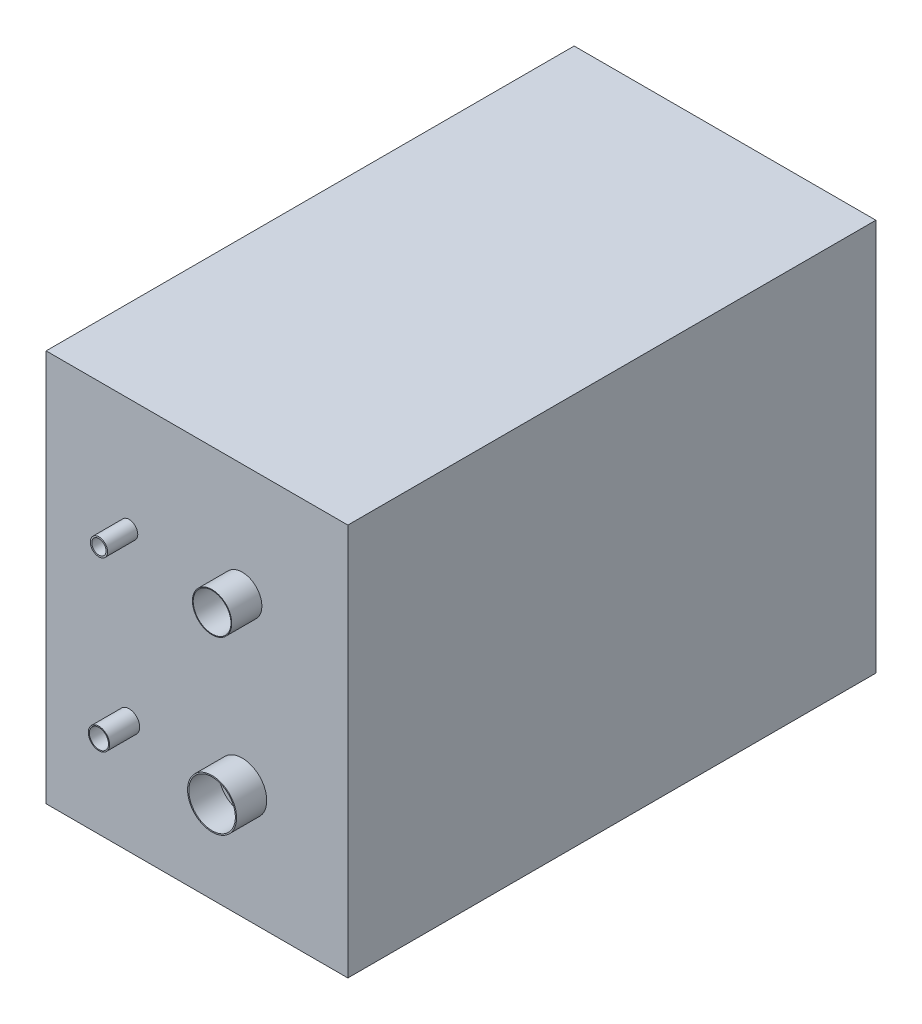
ISO-10303-21;
HEADER;
FILE_DESCRIPTION(('STEP AP214'),'2;1');
FILE_NAME('part.step','',(''),(''),'','','');
FILE_SCHEMA(('AUTOMOTIVE_DESIGN { 1 0 10303 214 1 1 1 1 }'));
ENDSEC;
DATA;
#1=APPLICATION_CONTEXT('core data for automotive mechanical design processes');
#2=APPLICATION_PROTOCOL_DEFINITION('international standard','automotive_design',2000,#1);
#3=PRODUCT_CONTEXT('',#1,'mechanical');
#4=PRODUCT('Part','Part','',(#3));
#5=PRODUCT_RELATED_PRODUCT_CATEGORY('part','',(#4));
#6=PRODUCT_DEFINITION_FORMATION('','',#4);
#7=PRODUCT_DEFINITION_CONTEXT('part definition',#1,'design');
#8=PRODUCT_DEFINITION('design','',#6,#7);
#9=PRODUCT_DEFINITION_SHAPE('','',#8);
#10=(LENGTH_UNIT() NAMED_UNIT(*) SI_UNIT(.MILLI.,.METRE.));
#11=(NAMED_UNIT(*) PLANE_ANGLE_UNIT() SI_UNIT($,.RADIAN.));
#12=(NAMED_UNIT(*) SI_UNIT($,.STERADIAN.) SOLID_ANGLE_UNIT());
#13=UNCERTAINTY_MEASURE_WITH_UNIT(LENGTH_MEASURE(1.E-05),#10,'distance_accuracy_value','');
#14=(GEOMETRIC_REPRESENTATION_CONTEXT(3) GLOBAL_UNCERTAINTY_ASSIGNED_CONTEXT((#13)) GLOBAL_UNIT_ASSIGNED_CONTEXT((#10,
#11,#12)) REPRESENTATION_CONTEXT('',''));
#15=CARTESIAN_POINT('',(0.,0.,0.));
#16=DIRECTION('',(0.,0.,1.));
#17=DIRECTION('',(1.,0.,0.));
#18=AXIS2_PLACEMENT_3D('',#15,#16,#17);
#19=CARTESIAN_POINT('',(-3900.,2571.50653560864,3500.));
#20=DIRECTION('',(0.,0.,1.));
#21=DIRECTION('',(1.,0.,0.));
#22=AXIS2_PLACEMENT_3D('',#19,#20,#21);
#23=PLANE('',#22);
#24=DIRECTION('',(0.,-1.,0.));
#25=VECTOR('',#24,1.);
#26=CARTESIAN_POINT('',(-3900.,5171.50653560865,3500.));
#27=LINE('',#26,#25);
#28=CARTESIAN_POINT('',(-3900.,5171.50653560865,3500.));
#29=VERTEX_POINT('',#28);
#30=CARTESIAN_POINT('',(-3900.,2571.50653560864,3500.));
#31=VERTEX_POINT('',#30);
#32=EDGE_CURVE('E83',#29,#31,#27,.T.);
#33=ORIENTED_EDGE('',*,*,#32,.T.);
#34=DIRECTION('',(1.,0.,0.));
#35=VECTOR('',#34,1.);
#36=CARTESIAN_POINT('',(-3900.,2571.50653560864,3500.));
#37=LINE('',#36,#35);
#38=CARTESIAN_POINT('',(-1900.,2571.50653560865,3500.));
#39=VERTEX_POINT('',#38);
#40=EDGE_CURVE('E78',#31,#39,#37,.T.);
#41=ORIENTED_EDGE('',*,*,#40,.T.);
#42=DIRECTION('',(0.,1.,0.));
#43=VECTOR('',#42,1.);
#44=CARTESIAN_POINT('',(-1900.,5171.50653560865,3500.));
#45=LINE('',#44,#43);
#46=CARTESIAN_POINT('',(-1900.,5171.50653560865,3500.));
#47=VERTEX_POINT('',#46);
#48=EDGE_CURVE('E81',#39,#47,#45,.T.);
#49=ORIENTED_EDGE('',*,*,#48,.T.);
#50=DIRECTION('',(-1.,0.,0.));
#51=VECTOR('',#50,1.);
#52=CARTESIAN_POINT('',(-3900.,5171.50653560865,3500.));
#53=LINE('',#52,#51);
#54=EDGE_CURVE('E47',#47,#29,#53,.T.);
#55=ORIENTED_EDGE('',*,*,#54,.T.);
#56=EDGE_LOOP('',(#33,#41,#49,#55));
#57=FACE_BOUND('',#56,.T.);
#58=CARTESIAN_POINT('',(-2600.,3321.50653560864,3500.));
#59=DIRECTION('',(0.,0.,1.));
#60=DIRECTION('',(1.,0.,0.));
#61=AXIS2_PLACEMENT_3D('',#58,#59,#60);
#62=CIRCLE('',#61,162.5);
#63=CARTESIAN_POINT('',(-2437.5,3321.50653560864,3500.));
#64=VERTEX_POINT('',#63);
#65=EDGE_CURVE('E186',#64,#64,#62,.T.);
#66=ORIENTED_EDGE('',*,*,#65,.F.);
#67=EDGE_LOOP('',(#66));
#68=FACE_BOUND('',#67,.T.);
#69=CARTESIAN_POINT('',(-3350.,3321.50653560864,3500.));
#70=DIRECTION('',(0.,0.,1.));
#71=DIRECTION('',(1.,0.,0.));
#72=AXIS2_PLACEMENT_3D('',#69,#70,#71);
#73=CIRCLE('',#72,70.5000000000003);
#74=CARTESIAN_POINT('',(-3279.5,3321.50653560864,3500.));
#75=VERTEX_POINT('',#74);
#76=EDGE_CURVE('E192',#75,#75,#73,.T.);
#77=ORIENTED_EDGE('',*,*,#76,.F.);
#78=EDGE_LOOP('',(#77));
#79=FACE_BOUND('',#78,.T.);
#80=CARTESIAN_POINT('',(-2600.,4421.50653560865,3500.));
#81=DIRECTION('',(0.,0.,1.));
#82=DIRECTION('',(1.,0.,0.));
#83=AXIS2_PLACEMENT_3D('',#80,#81,#82);
#84=CIRCLE('',#83,130.);
#85=CARTESIAN_POINT('',(-2470.,4421.50653560865,3500.));
#86=VERTEX_POINT('',#85);
#87=EDGE_CURVE('E202',#86,#86,#84,.T.);
#88=ORIENTED_EDGE('',*,*,#87,.F.);
#89=EDGE_LOOP('',(#88));
#90=FACE_BOUND('',#89,.T.);
#91=CARTESIAN_POINT('',(-3350.,4421.50653560865,3500.));
#92=DIRECTION('',(0.,0.,1.));
#93=DIRECTION('',(1.,0.,0.));
#94=AXIS2_PLACEMENT_3D('',#91,#92,#93);
#95=CIRCLE('',#94,57.5);
#96=CARTESIAN_POINT('',(-3292.5,4421.50653560865,3500.));
#97=VERTEX_POINT('',#96);
#98=EDGE_CURVE('E211',#97,#97,#95,.T.);
#99=ORIENTED_EDGE('',*,*,#98,.F.);
#100=EDGE_LOOP('',(#99));
#101=FACE_BOUND('',#100,.T.);
#102=ADVANCED_FACE('F30',(#57,#68,#79,#90,#101),#23,.T.);
#103=CARTESIAN_POINT('',(-3900.,5171.50653560865,3500.));
#104=DIRECTION('',(1.,0.,0.));
#105=DIRECTION('',(0.,1.,0.));
#106=AXIS2_PLACEMENT_3D('',#103,#104,#105);
#107=PLANE('',#106);
#108=DIRECTION('',(0.,-1.,0.));
#109=VECTOR('',#108,1.);
#110=CARTESIAN_POINT('',(-3900.,5171.50653560865,0.));
#111=LINE('',#110,#109);
#112=CARTESIAN_POINT('',(-3900.,5171.50653560865,0.));
#113=VERTEX_POINT('',#112);
#114=CARTESIAN_POINT('',(-3900.,2571.50653560864,0.));
#115=VERTEX_POINT('',#114);
#116=EDGE_CURVE('E98',#113,#115,#111,.T.);
#117=ORIENTED_EDGE('',*,*,#116,.T.);
#118=DIRECTION('',(0.,0.,-1.));
#119=VECTOR('',#118,1.);
#120=CARTESIAN_POINT('',(-3900.,2571.50653560864,3500.));
#121=LINE('',#120,#119);
#122=EDGE_CURVE('E89',#31,#115,#121,.T.);
#123=ORIENTED_EDGE('',*,*,#122,.F.);
#124=ORIENTED_EDGE('',*,*,#32,.F.);
#125=DIRECTION('',(0.,0.,-1.));
#126=VECTOR('',#125,1.);
#127=CARTESIAN_POINT('',(-3900.,5171.50653560865,3500.));
#128=LINE('',#127,#126);
#129=EDGE_CURVE('E94',#29,#113,#128,.T.);
#130=ORIENTED_EDGE('',*,*,#129,.T.);
#131=EDGE_LOOP('',(#117,#123,#124,#130));
#132=FACE_BOUND('',#131,.T.);
#133=ADVANCED_FACE('F32',(#132),#107,.F.);
#134=CARTESIAN_POINT('',(-3900.,2571.50653560864,3500.));
#135=DIRECTION('',(0.,1.,0.));
#136=DIRECTION('',(0.,0.,1.));
#137=AXIS2_PLACEMENT_3D('',#134,#135,#136);
#138=PLANE('',#137);
#139=DIRECTION('',(1.,0.,0.));
#140=VECTOR('',#139,1.);
#141=CARTESIAN_POINT('',(-3900.,2571.50653560864,0.));
#142=LINE('',#141,#140);
#143=CARTESIAN_POINT('',(-1900.,2571.50653560865,0.));
#144=VERTEX_POINT('',#143);
#145=EDGE_CURVE('E88',#115,#144,#142,.T.);
#146=ORIENTED_EDGE('',*,*,#145,.T.);
#147=DIRECTION('',(0.,0.,-1.));
#148=VECTOR('',#147,1.);
#149=CARTESIAN_POINT('',(-1900.,2571.50653560865,3500.));
#150=LINE('',#149,#148);
#151=EDGE_CURVE('E86',#39,#144,#150,.T.);
#152=ORIENTED_EDGE('',*,*,#151,.F.);
#153=ORIENTED_EDGE('',*,*,#40,.F.);
#154=ORIENTED_EDGE('',*,*,#122,.T.);
#155=EDGE_LOOP('',(#146,#152,#153,#154));
#156=FACE_BOUND('',#155,.T.);
#157=ADVANCED_FACE('F87',(#156),#138,.F.);
#158=CARTESIAN_POINT('',(-1900.,5171.50653560865,3500.));
#159=DIRECTION('',(-1.,0.,0.));
#160=DIRECTION('',(0.,0.,1.));
#161=AXIS2_PLACEMENT_3D('',#158,#159,#160);
#162=PLANE('',#161);
#163=DIRECTION('',(0.,1.,0.));
#164=VECTOR('',#163,1.);
#165=CARTESIAN_POINT('',(-1900.,5171.50653560865,0.));
#166=LINE('',#165,#164);
#167=CARTESIAN_POINT('',(-1900.,5171.50653560865,0.));
#168=VERTEX_POINT('',#167);
#169=EDGE_CURVE('E64',#144,#168,#166,.T.);
#170=ORIENTED_EDGE('',*,*,#169,.T.);
#171=DIRECTION('',(0.,0.,-1.));
#172=VECTOR('',#171,1.);
#173=CARTESIAN_POINT('',(-1900.,5171.50653560865,3500.));
#174=LINE('',#173,#172);
#175=EDGE_CURVE('E90',#47,#168,#174,.T.);
#176=ORIENTED_EDGE('',*,*,#175,.F.);
#177=ORIENTED_EDGE('',*,*,#48,.F.);
#178=ORIENTED_EDGE('',*,*,#151,.T.);
#179=EDGE_LOOP('',(#170,#176,#177,#178));
#180=FACE_BOUND('',#179,.T.);
#181=ADVANCED_FACE('F92',(#180),#162,.F.);
#182=CARTESIAN_POINT('',(-3900.,5171.50653560865,3500.));
#183=DIRECTION('',(0.,-1.,0.));
#184=DIRECTION('',(0.,0.,-1.));
#185=AXIS2_PLACEMENT_3D('',#182,#183,#184);
#186=PLANE('',#185);
#187=DIRECTION('',(-1.,0.,0.));
#188=VECTOR('',#187,1.);
#189=CARTESIAN_POINT('',(-3900.,5171.50653560865,0.));
#190=LINE('',#189,#188);
#191=EDGE_CURVE('E70',#168,#113,#190,.T.);
#192=ORIENTED_EDGE('',*,*,#191,.T.);
#193=ORIENTED_EDGE('',*,*,#129,.F.);
#194=ORIENTED_EDGE('',*,*,#54,.F.);
#195=ORIENTED_EDGE('',*,*,#175,.T.);
#196=EDGE_LOOP('',(#192,#193,#194,#195));
#197=FACE_BOUND('',#196,.T.);
#198=ADVANCED_FACE('F179',(#197),#186,.F.);
#199=CARTESIAN_POINT('',(-3900.,2571.50653560864,0.));
#200=DIRECTION('',(0.,0.,1.));
#201=DIRECTION('',(1.,0.,0.));
#202=AXIS2_PLACEMENT_3D('',#199,#200,#201);
#203=PLANE('',#202);
#204=ORIENTED_EDGE('',*,*,#116,.F.);
#205=ORIENTED_EDGE('',*,*,#191,.F.);
#206=ORIENTED_EDGE('',*,*,#169,.F.);
#207=ORIENTED_EDGE('',*,*,#145,.F.);
#208=EDGE_LOOP('',(#204,#205,#206,#207));
#209=FACE_BOUND('',#208,.T.);
#210=ADVANCED_FACE('F174',(#209),#203,.F.);
#211=CARTESIAN_POINT('',(-2600.,3321.50653560864,3700.));
#212=DIRECTION('',(0.,0.,1.));
#213=DIRECTION('',(1.,0.,0.));
#214=AXIS2_PLACEMENT_3D('',#211,#212,#213);
#215=PLANE('',#214);
#216=CARTESIAN_POINT('',(-2600.,3321.50653560864,3700.));
#217=DIRECTION('',(0.,0.,1.));
#218=DIRECTION('',(1.,0.,0.));
#219=AXIS2_PLACEMENT_3D('',#216,#217,#218);
#220=CIRCLE('',#219,162.5);
#221=CARTESIAN_POINT('',(-2437.5,3321.50653560864,3700.));
#222=VERTEX_POINT('',#221);
#223=EDGE_CURVE('E101',#222,#222,#220,.T.);
#224=ORIENTED_EDGE('',*,*,#223,.T.);
#225=EDGE_LOOP('',(#224));
#226=FACE_BOUND('',#225,.T.);
#227=CARTESIAN_POINT('',(-2600.,3321.50653560864,3700.));
#228=DIRECTION('',(0.,0.,1.));
#229=DIRECTION('',(1.,0.,0.));
#230=AXIS2_PLACEMENT_3D('',#227,#228,#229);
#231=CIRCLE('',#230,154.5);
#232=CARTESIAN_POINT('',(-2445.5,3321.50653560864,3700.));
#233=VERTEX_POINT('',#232);
#234=EDGE_CURVE('E185',#233,#233,#231,.T.);
#235=ORIENTED_EDGE('',*,*,#234,.F.);
#236=EDGE_LOOP('',(#235));
#237=FACE_BOUND('',#236,.T.);
#238=ADVANCED_FACE('F168',(#226,#237),#215,.T.);
#239=CARTESIAN_POINT('',(-2600.,3321.50653560864,3700.));
#240=DIRECTION('',(0.,0.,-1.));
#241=DIRECTION('',(-1.,0.,0.));
#242=AXIS2_PLACEMENT_3D('',#239,#240,#241);
#243=CYLINDRICAL_SURFACE('',#242,162.5);
#244=ORIENTED_EDGE('',*,*,#223,.F.);
#245=EDGE_LOOP('',(#244));
#246=FACE_BOUND('',#245,.T.);
#247=ORIENTED_EDGE('',*,*,#65,.T.);
#248=EDGE_LOOP('',(#247));
#249=FACE_BOUND('',#248,.T.);
#250=ADVANCED_FACE('F160',(#246,#249),#243,.T.);
#251=CARTESIAN_POINT('',(-2600.,3321.50653560864,3700.));
#252=DIRECTION('',(0.,0.,-1.));
#253=DIRECTION('',(-1.,0.,0.));
#254=AXIS2_PLACEMENT_3D('',#251,#252,#253);
#255=CYLINDRICAL_SURFACE('',#254,154.5);
#256=ORIENTED_EDGE('',*,*,#234,.T.);
#257=EDGE_LOOP('',(#256));
#258=FACE_BOUND('',#257,.T.);
#259=CARTESIAN_POINT('',(-2600.,3321.50653560864,3500.));
#260=DIRECTION('',(0.,0.,1.));
#261=DIRECTION('',(1.,0.,0.));
#262=AXIS2_PLACEMENT_3D('',#259,#260,#261);
#263=CIRCLE('',#262,154.5);
#264=CARTESIAN_POINT('',(-2445.5,3321.50653560864,3500.));
#265=VERTEX_POINT('',#264);
#266=EDGE_CURVE('E108',#265,#265,#263,.F.);
#267=ORIENTED_EDGE('',*,*,#266,.T.);
#268=EDGE_LOOP('',(#267));
#269=FACE_BOUND('',#268,.T.);
#270=ADVANCED_FACE('F151',(#258,#269),#255,.F.);
#271=ORIENTED_EDGE('',*,*,#266,.F.);
#272=EDGE_LOOP('',(#271));
#273=FACE_BOUND('',#272,.T.);
#274=ADVANCED_FACE('F134',(#273),#23,.T.);
#275=CARTESIAN_POINT('',(-3350.,3321.50653560864,3700.));
#276=DIRECTION('',(0.,0.,1.));
#277=DIRECTION('',(1.,0.,0.));
#278=AXIS2_PLACEMENT_3D('',#275,#276,#277);
#279=PLANE('',#278);
#280=CARTESIAN_POINT('',(-3350.,3321.50653560864,3700.));
#281=DIRECTION('',(0.,0.,1.));
#282=DIRECTION('',(1.,0.,0.));
#283=AXIS2_PLACEMENT_3D('',#280,#281,#282);
#284=CIRCLE('',#283,70.5000000000003);
#285=CARTESIAN_POINT('',(-3279.5,3321.50653560864,3700.));
#286=VERTEX_POINT('',#285);
#287=EDGE_CURVE('E187',#286,#286,#284,.T.);
#288=ORIENTED_EDGE('',*,*,#287,.T.);
#289=EDGE_LOOP('',(#288));
#290=FACE_BOUND('',#289,.T.);
#291=CARTESIAN_POINT('',(-3350.,3321.50653560864,3700.));
#292=DIRECTION('',(0.,0.,1.));
#293=DIRECTION('',(1.,0.,0.));
#294=AXIS2_PLACEMENT_3D('',#291,#292,#293);
#295=CIRCLE('',#294,63.4999999999998);
#296=CARTESIAN_POINT('',(-3286.5,3321.50653560864,3700.));
#297=VERTEX_POINT('',#296);
#298=EDGE_CURVE('E197',#297,#297,#295,.T.);
#299=ORIENTED_EDGE('',*,*,#298,.F.);
#300=EDGE_LOOP('',(#299));
#301=FACE_BOUND('',#300,.T.);
#302=ADVANCED_FACE('F150',(#290,#301),#279,.T.);
#303=CARTESIAN_POINT('',(-3350.,3321.50653560864,3700.));
#304=DIRECTION('',(0.,0.,-1.));
#305=DIRECTION('',(-1.,0.,0.));
#306=AXIS2_PLACEMENT_3D('',#303,#304,#305);
#307=CYLINDRICAL_SURFACE('',#306,70.5000000000003);
#308=ORIENTED_EDGE('',*,*,#287,.F.);
#309=EDGE_LOOP('',(#308));
#310=FACE_BOUND('',#309,.T.);
#311=ORIENTED_EDGE('',*,*,#76,.T.);
#312=EDGE_LOOP('',(#311));
#313=FACE_BOUND('',#312,.T.);
#314=ADVANCED_FACE('F157',(#310,#313),#307,.T.);
#315=CARTESIAN_POINT('',(-3350.,3321.50653560864,3700.));
#316=DIRECTION('',(0.,0.,-1.));
#317=DIRECTION('',(-1.,0.,0.));
#318=AXIS2_PLACEMENT_3D('',#315,#316,#317);
#319=CYLINDRICAL_SURFACE('',#318,63.4999999999998);
#320=ORIENTED_EDGE('',*,*,#298,.T.);
#321=EDGE_LOOP('',(#320));
#322=FACE_BOUND('',#321,.T.);
#323=CARTESIAN_POINT('',(-3350.,3321.50653560864,3500.));
#324=DIRECTION('',(0.,0.,1.));
#325=DIRECTION('',(1.,0.,0.));
#326=AXIS2_PLACEMENT_3D('',#323,#324,#325);
#327=CIRCLE('',#326,63.4999999999998);
#328=CARTESIAN_POINT('',(-3286.5,3321.50653560864,3500.));
#329=VERTEX_POINT('',#328);
#330=EDGE_CURVE('E111',#329,#329,#327,.F.);
#331=ORIENTED_EDGE('',*,*,#330,.T.);
#332=EDGE_LOOP('',(#331));
#333=FACE_BOUND('',#332,.T.);
#334=ADVANCED_FACE('F139',(#322,#333),#319,.F.);
#335=ORIENTED_EDGE('',*,*,#330,.F.);
#336=EDGE_LOOP('',(#335));
#337=FACE_BOUND('',#336,.T.);
#338=ADVANCED_FACE('F122',(#337),#23,.T.);
#339=CARTESIAN_POINT('',(-2600.,4421.50653560865,3700.));
#340=DIRECTION('',(0.,0.,1.));
#341=DIRECTION('',(1.,0.,0.));
#342=AXIS2_PLACEMENT_3D('',#339,#340,#341);
#343=PLANE('',#342);
#344=CARTESIAN_POINT('',(-2600.,4421.50653560865,3700.));
#345=DIRECTION('',(0.,0.,1.));
#346=DIRECTION('',(1.,0.,0.));
#347=AXIS2_PLACEMENT_3D('',#344,#345,#346);
#348=CIRCLE('',#347,130.);
#349=CARTESIAN_POINT('',(-2470.,4421.50653560865,3700.));
#350=VERTEX_POINT('',#349);
#351=EDGE_CURVE('E201',#350,#350,#348,.T.);
#352=ORIENTED_EDGE('',*,*,#351,.T.);
#353=EDGE_LOOP('',(#352));
#354=FACE_BOUND('',#353,.T.);
#355=CARTESIAN_POINT('',(-2600.,4421.50653560865,3700.));
#356=DIRECTION('',(0.,0.,1.));
#357=DIRECTION('',(1.,0.,0.));
#358=AXIS2_PLACEMENT_3D('',#355,#356,#357);
#359=CIRCLE('',#358,125.);
#360=CARTESIAN_POINT('',(-2475.,4421.50653560865,3700.));
#361=VERTEX_POINT('',#360);
#362=EDGE_CURVE('E205',#361,#361,#359,.T.);
#363=ORIENTED_EDGE('',*,*,#362,.F.);
#364=EDGE_LOOP('',(#363));
#365=FACE_BOUND('',#364,.T.);
#366=ADVANCED_FACE('F138',(#354,#365),#343,.T.);
#367=CARTESIAN_POINT('',(-2600.,4421.50653560865,3700.));
#368=DIRECTION('',(0.,0.,-1.));
#369=DIRECTION('',(-1.,0.,0.));
#370=AXIS2_PLACEMENT_3D('',#367,#368,#369);
#371=CYLINDRICAL_SURFACE('',#370,130.);
#372=ORIENTED_EDGE('',*,*,#351,.F.);
#373=EDGE_LOOP('',(#372));
#374=FACE_BOUND('',#373,.T.);
#375=ORIENTED_EDGE('',*,*,#87,.T.);
#376=EDGE_LOOP('',(#375));
#377=FACE_BOUND('',#376,.T.);
#378=ADVANCED_FACE('F131',(#374,#377),#371,.T.);
#379=CARTESIAN_POINT('',(-2600.,4421.50653560865,3700.));
#380=DIRECTION('',(0.,0.,-1.));
#381=DIRECTION('',(-1.,0.,0.));
#382=AXIS2_PLACEMENT_3D('',#379,#380,#381);
#383=CYLINDRICAL_SURFACE('',#382,125.);
#384=ORIENTED_EDGE('',*,*,#362,.T.);
#385=EDGE_LOOP('',(#384));
#386=FACE_BOUND('',#385,.T.);
#387=CARTESIAN_POINT('',(-2600.,4421.50653560865,3500.));
#388=DIRECTION('',(0.,0.,1.));
#389=DIRECTION('',(1.,0.,0.));
#390=AXIS2_PLACEMENT_3D('',#387,#388,#389);
#391=CIRCLE('',#390,125.);
#392=CARTESIAN_POINT('',(-2475.,4421.50653560865,3500.));
#393=VERTEX_POINT('',#392);
#394=EDGE_CURVE('E39',#393,#393,#391,.F.);
#395=ORIENTED_EDGE('',*,*,#394,.T.);
#396=EDGE_LOOP('',(#395));
#397=FACE_BOUND('',#396,.T.);
#398=ADVANCED_FACE('F116',(#386,#397),#383,.F.);
#399=ORIENTED_EDGE('',*,*,#394,.F.);
#400=EDGE_LOOP('',(#399));
#401=FACE_BOUND('',#400,.T.);
#402=ADVANCED_FACE('F118',(#401),#23,.T.);
#403=CARTESIAN_POINT('',(-3350.,4421.50653560864,3700.));
#404=DIRECTION('',(0.,0.,1.));
#405=DIRECTION('',(1.,0.,0.));
#406=AXIS2_PLACEMENT_3D('',#403,#404,#405);
#407=PLANE('',#406);
#408=CARTESIAN_POINT('',(-3350.,4421.50653560864,3700.));
#409=DIRECTION('',(0.,0.,1.));
#410=DIRECTION('',(1.,0.,0.));
#411=AXIS2_PLACEMENT_3D('',#408,#409,#410);
#412=CIRCLE('',#411,57.5);
#413=CARTESIAN_POINT('',(-3292.5,4421.50653560864,3700.));
#414=VERTEX_POINT('',#413);
#415=EDGE_CURVE('E210',#414,#414,#412,.T.);
#416=ORIENTED_EDGE('',*,*,#415,.T.);
#417=EDGE_LOOP('',(#416));
#418=FACE_BOUND('',#417,.T.);
#419=CARTESIAN_POINT('',(-3350.,4421.50653560864,3700.));
#420=DIRECTION('',(0.,0.,1.));
#421=DIRECTION('',(1.,0.,0.));
#422=AXIS2_PLACEMENT_3D('',#419,#420,#421);
#423=CIRCLE('',#422,47.5);
#424=CARTESIAN_POINT('',(-3302.5,4421.50653560864,3700.));
#425=VERTEX_POINT('',#424);
#426=EDGE_CURVE('E214',#425,#425,#423,.T.);
#427=ORIENTED_EDGE('',*,*,#426,.F.);
#428=EDGE_LOOP('',(#427));
#429=FACE_BOUND('',#428,.T.);
#430=ADVANCED_FACE('F120',(#418,#429),#407,.T.);
#431=CARTESIAN_POINT('',(-3350.,4421.50653560864,3700.));
#432=DIRECTION('',(0.,0.,-1.));
#433=DIRECTION('',(-1.,0.,0.));
#434=AXIS2_PLACEMENT_3D('',#431,#432,#433);
#435=CYLINDRICAL_SURFACE('',#434,57.5);
#436=ORIENTED_EDGE('',*,*,#415,.F.);
#437=EDGE_LOOP('',(#436));
#438=FACE_BOUND('',#437,.T.);
#439=ORIENTED_EDGE('',*,*,#98,.T.);
#440=EDGE_LOOP('',(#439));
#441=FACE_BOUND('',#440,.T.);
#442=ADVANCED_FACE('F128',(#438,#441),#435,.T.);
#443=CARTESIAN_POINT('',(-3350.,4421.50653560864,3700.));
#444=DIRECTION('',(0.,0.,-1.));
#445=DIRECTION('',(-1.,0.,0.));
#446=AXIS2_PLACEMENT_3D('',#443,#444,#445);
#447=CYLINDRICAL_SURFACE('',#446,47.5);
#448=ORIENTED_EDGE('',*,*,#426,.T.);
#449=EDGE_LOOP('',(#448));
#450=FACE_BOUND('',#449,.T.);
#451=CARTESIAN_POINT('',(-3350.,4421.50653560865,3500.));
#452=DIRECTION('',(0.,0.,1.));
#453=DIRECTION('',(1.,0.,0.));
#454=AXIS2_PLACEMENT_3D('',#451,#452,#453);
#455=CIRCLE('',#454,47.5);
#456=CARTESIAN_POINT('',(-3302.5,4421.50653560865,3500.));
#457=VERTEX_POINT('',#456);
#458=EDGE_CURVE('E11',#457,#457,#455,.F.);
#459=ORIENTED_EDGE('',*,*,#458,.T.);
#460=EDGE_LOOP('',(#459));
#461=FACE_BOUND('',#460,.T.);
#462=ADVANCED_FACE('F142',(#450,#461),#447,.F.);
#463=ORIENTED_EDGE('',*,*,#458,.F.);
#464=EDGE_LOOP('',(#463));
#465=FACE_BOUND('',#464,.T.);
#466=ADVANCED_FACE('F123',(#465),#23,.T.);
#467=CLOSED_SHELL('',(#102,#133,#157,#181,#198,#210,#238,#250,#270,#274,#302,#314,#334,#338,
#366,#378,#398,#402,#430,#442,#462,#466));
#468=MANIFOLD_SOLID_BREP('B2',#467);
#469=ADVANCED_BREP_SHAPE_REPRESENTATION('',(#18,#468),#14);
#470=SHAPE_DEFINITION_REPRESENTATION(#9,#469);
ENDSEC;
END-ISO-10303-21;
